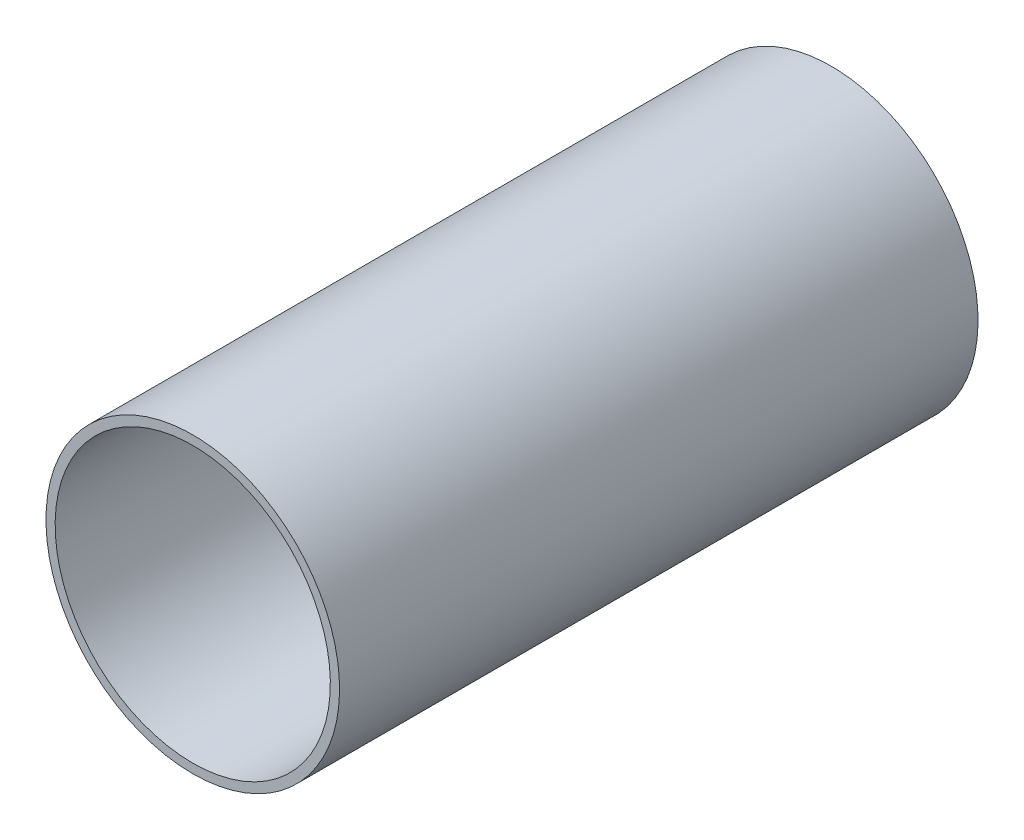
ISO-10303-21;
HEADER;
FILE_DESCRIPTION(('STEP AP214'),'2;1');
FILE_NAME('part.step','',(''),(''),'','','');
FILE_SCHEMA(('AUTOMOTIVE_DESIGN { 1 0 10303 214 1 1 1 1 }'));
ENDSEC;
DATA;
#1=APPLICATION_CONTEXT('core data for automotive mechanical design processes');
#2=APPLICATION_PROTOCOL_DEFINITION('international standard','automotive_design',2000,#1);
#3=PRODUCT_CONTEXT('',#1,'mechanical');
#4=PRODUCT('Part','Part','',(#3));
#5=PRODUCT_RELATED_PRODUCT_CATEGORY('part','',(#4));
#6=PRODUCT_DEFINITION_FORMATION('','',#4);
#7=PRODUCT_DEFINITION_CONTEXT('part definition',#1,'design');
#8=PRODUCT_DEFINITION('design','',#6,#7);
#9=PRODUCT_DEFINITION_SHAPE('','',#8);
#10=(LENGTH_UNIT() NAMED_UNIT(*) SI_UNIT(.MILLI.,.METRE.));
#11=(NAMED_UNIT(*) PLANE_ANGLE_UNIT() SI_UNIT($,.RADIAN.));
#12=(NAMED_UNIT(*) SI_UNIT($,.STERADIAN.) SOLID_ANGLE_UNIT());
#13=UNCERTAINTY_MEASURE_WITH_UNIT(LENGTH_MEASURE(1.E-05),#10,'distance_accuracy_value','');
#14=(GEOMETRIC_REPRESENTATION_CONTEXT(3) GLOBAL_UNCERTAINTY_ASSIGNED_CONTEXT((#13)) GLOBAL_UNIT_ASSIGNED_CONTEXT((#10,
#11,#12)) REPRESENTATION_CONTEXT('',''));
#15=CARTESIAN_POINT('',(0.,0.,0.));
#16=DIRECTION('',(0.,0.,1.));
#17=DIRECTION('',(1.,0.,0.));
#18=AXIS2_PLACEMENT_3D('',#15,#16,#17);
#19=CARTESIAN_POINT('',(167.63728,-80.77568,-0.045));
#20=DIRECTION('',(0.,0.,-1.));
#21=DIRECTION('',(0.,-1.,0.));
#22=AXIS2_PLACEMENT_3D('',#19,#20,#21);
#23=CYLINDRICAL_SURFACE('',#22,0.375);
#24=CARTESIAN_POINT('',(167.63728,-80.77568,-0.035));
#25=DIRECTION('',(0.,0.,-1.));
#26=DIRECTION('',(0.,-1.,0.));
#27=AXIS2_PLACEMENT_3D('',#24,#25,#26);
#28=CIRCLE('',#27,0.375);
#29=CARTESIAN_POINT('',(167.63728,-81.15068,-0.035));
#30=VERTEX_POINT('',#29);
#31=EDGE_CURVE('E64',#30,#30,#28,.T.);
#32=ORIENTED_EDGE('',*,*,#31,.T.);
#33=DIRECTION('',(0.,0.,1.));
#34=VECTOR('',#33,1.);
#35=CARTESIAN_POINT('',(167.63728,-81.15068,-0.045));
#36=LINE('',#35,#34);
#37=CARTESIAN_POINT('',(167.63728,-81.15068,1.705));
#38=VERTEX_POINT('',#37);
#39=EDGE_CURVE('E11',#30,#38,#36,.T.);
#40=ORIENTED_EDGE('',*,*,#39,.T.);
#41=CARTESIAN_POINT('',(167.63728,-80.77568,1.705));
#42=DIRECTION('',(0.,0.,-1.));
#43=DIRECTION('',(0.,-1.,0.));
#44=AXIS2_PLACEMENT_3D('',#41,#42,#43);
#45=CIRCLE('',#44,0.375);
#46=EDGE_CURVE('E25',#38,#38,#45,.T.);
#47=ORIENTED_EDGE('',*,*,#46,.F.);
#48=ORIENTED_EDGE('',*,*,#39,.F.);
#49=EDGE_LOOP('',(#32,#40,#47,#48));
#50=FACE_BOUND('',#49,.T.);
#51=ADVANCED_FACE('F17',(#50),#23,.F.);
#52=CARTESIAN_POINT('',(167.63728,-81.17568,1.705));
#53=DIRECTION('',(0.,0.,1.));
#54=DIRECTION('',(1.,0.,0.));
#55=AXIS2_PLACEMENT_3D('',#52,#53,#54);
#56=PLANE('',#55);
#57=ORIENTED_EDGE('',*,*,#46,.T.);
#58=EDGE_LOOP('',(#57));
#59=FACE_BOUND('',#58,.T.);
#60=CARTESIAN_POINT('',(167.63728,-80.77568,1.705));
#61=DIRECTION('',(0.,0.,1.));
#62=DIRECTION('',(0.,-1.,0.));
#63=AXIS2_PLACEMENT_3D('',#60,#61,#62);
#64=CIRCLE('',#63,0.4);
#65=CARTESIAN_POINT('',(167.63728,-81.17568,1.705));
#66=VERTEX_POINT('',#65);
#67=EDGE_CURVE('E56',#66,#66,#64,.T.);
#68=ORIENTED_EDGE('',*,*,#67,.T.);
#69=EDGE_LOOP('',(#68));
#70=FACE_BOUND('',#69,.T.);
#71=ADVANCED_FACE('F73',(#59,#70),#56,.T.);
#72=CARTESIAN_POINT('',(167.63728,-81.17568,-0.035));
#73=DIRECTION('',(0.,0.,1.));
#74=DIRECTION('',(1.,0.,0.));
#75=AXIS2_PLACEMENT_3D('',#72,#73,#74);
#76=PLANE('',#75);
#77=ORIENTED_EDGE('',*,*,#31,.F.);
#78=EDGE_LOOP('',(#77));
#79=FACE_BOUND('',#78,.T.);
#80=CARTESIAN_POINT('',(167.63728,-80.77568,-0.035));
#81=DIRECTION('',(0.,0.,1.));
#82=DIRECTION('',(0.,-1.,0.));
#83=AXIS2_PLACEMENT_3D('',#80,#81,#82);
#84=CIRCLE('',#83,0.4);
#85=CARTESIAN_POINT('',(167.63728,-81.17568,-0.035));
#86=VERTEX_POINT('',#85);
#87=EDGE_CURVE('E55',#86,#86,#84,.T.);
#88=ORIENTED_EDGE('',*,*,#87,.F.);
#89=EDGE_LOOP('',(#88));
#90=FACE_BOUND('',#89,.T.);
#91=ADVANCED_FACE('F82',(#79,#90),#76,.F.);
#92=CARTESIAN_POINT('',(167.63728,-80.77568,-0.035));
#93=DIRECTION('',(0.,0.,-1.));
#94=DIRECTION('',(0.,-1.,0.));
#95=AXIS2_PLACEMENT_3D('',#92,#93,#94);
#96=CYLINDRICAL_SURFACE('',#95,0.4);
#97=ORIENTED_EDGE('',*,*,#87,.T.);
#98=DIRECTION('',(0.,0.,1.));
#99=VECTOR('',#98,1.);
#100=CARTESIAN_POINT('',(167.63728,-81.17568,-0.035));
#101=LINE('',#100,#99);
#102=EDGE_CURVE('E52',#86,#66,#101,.T.);
#103=ORIENTED_EDGE('',*,*,#102,.T.);
#104=ORIENTED_EDGE('',*,*,#67,.F.);
#105=ORIENTED_EDGE('',*,*,#102,.F.);
#106=EDGE_LOOP('',(#97,#103,#104,#105));
#107=FACE_BOUND('',#106,.T.);
#108=ADVANCED_FACE('F53',(#107),#96,.T.);
#109=CLOSED_SHELL('',(#51,#71,#91,#108));
#110=MANIFOLD_SOLID_BREP('B1',#109);
#111=ADVANCED_BREP_SHAPE_REPRESENTATION('',(#18,#110),#14);
#112=SHAPE_DEFINITION_REPRESENTATION(#9,#111);
ENDSEC;
END-ISO-10303-21;
